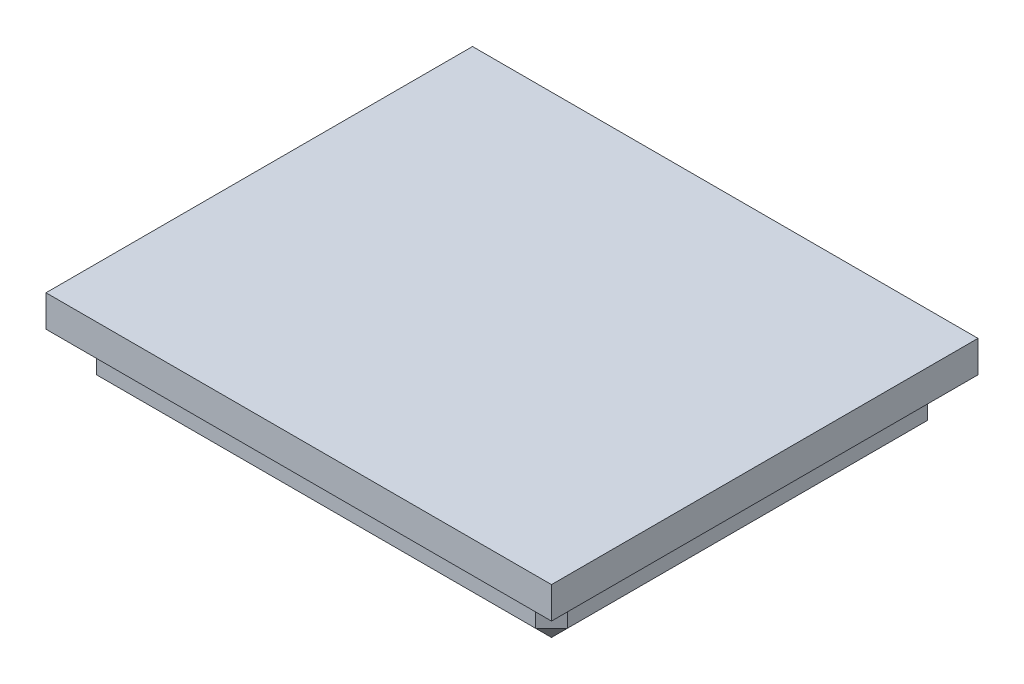
ISO-10303-21;
HEADER;
FILE_DESCRIPTION(('STEP AP214'),'2;1');
FILE_NAME('part.step','',(''),(''),'','','');
FILE_SCHEMA(('AUTOMOTIVE_DESIGN { 1 0 10303 214 1 1 1 1 }'));
ENDSEC;
DATA;
#1=APPLICATION_CONTEXT('core data for automotive mechanical design processes');
#2=APPLICATION_PROTOCOL_DEFINITION('international standard','automotive_design',2000,#1);
#3=PRODUCT_CONTEXT('',#1,'mechanical');
#4=PRODUCT('Part','Part','',(#3));
#5=PRODUCT_RELATED_PRODUCT_CATEGORY('part','',(#4));
#6=PRODUCT_DEFINITION_FORMATION('','',#4);
#7=PRODUCT_DEFINITION_CONTEXT('part definition',#1,'design');
#8=PRODUCT_DEFINITION('design','',#6,#7);
#9=PRODUCT_DEFINITION_SHAPE('','',#8);
#10=(LENGTH_UNIT() NAMED_UNIT(*) SI_UNIT(.MILLI.,.METRE.));
#11=(NAMED_UNIT(*) PLANE_ANGLE_UNIT() SI_UNIT($,.RADIAN.));
#12=(NAMED_UNIT(*) SI_UNIT($,.STERADIAN.) SOLID_ANGLE_UNIT());
#13=UNCERTAINTY_MEASURE_WITH_UNIT(LENGTH_MEASURE(1.E-05),#10,'distance_accuracy_value','');
#14=(GEOMETRIC_REPRESENTATION_CONTEXT(3) GLOBAL_UNCERTAINTY_ASSIGNED_CONTEXT((#13)) GLOBAL_UNIT_ASSIGNED_CONTEXT((#10,
#11,#12)) REPRESENTATION_CONTEXT('',''));
#15=CARTESIAN_POINT('',(0.,0.,0.));
#16=DIRECTION('',(0.,0.,1.));
#17=DIRECTION('',(1.,0.,0.));
#18=AXIS2_PLACEMENT_3D('',#15,#16,#17);
#19=CARTESIAN_POINT('',(-14.9,3.,12.4));
#20=DIRECTION('',(1.,0.,0.));
#21=DIRECTION('',(0.,0.,-1.));
#22=AXIS2_PLACEMENT_3D('',#19,#20,#21);
#23=PLANE('',#22);
#24=DIRECTION('',(0.,0.,1.));
#25=VECTOR('',#24,1.);
#26=CARTESIAN_POINT('',(-14.9,1.,12.4));
#27=LINE('',#26,#25);
#28=CARTESIAN_POINT('',(-14.9,1.,-11.4));
#29=VERTEX_POINT('',#28);
#30=CARTESIAN_POINT('',(-14.9,1.,11.4));
#31=VERTEX_POINT('',#30);
#32=EDGE_CURVE('E191',#29,#31,#27,.T.);
#33=ORIENTED_EDGE('',*,*,#32,.T.);
#34=DIRECTION('',(0.,1.,0.));
#35=VECTOR('',#34,1.);
#36=CARTESIAN_POINT('',(-14.9,3.,11.4));
#37=LINE('',#36,#35);
#38=CARTESIAN_POINT('',(-14.9,3.,11.4));
#39=VERTEX_POINT('',#38);
#40=EDGE_CURVE('E195',#31,#39,#37,.T.);
#41=ORIENTED_EDGE('',*,*,#40,.T.);
#42=DIRECTION('',(0.,0.,1.));
#43=VECTOR('',#42,1.);
#44=CARTESIAN_POINT('',(-14.9,3.,12.4));
#45=LINE('',#44,#43);
#46=CARTESIAN_POINT('',(-14.9,3.,-11.4));
#47=VERTEX_POINT('',#46);
#48=EDGE_CURVE('E161',#47,#39,#45,.T.);
#49=ORIENTED_EDGE('',*,*,#48,.F.);
#50=DIRECTION('',(0.,-1.,0.));
#51=VECTOR('',#50,1.);
#52=CARTESIAN_POINT('',(-14.9,3.,-11.4));
#53=LINE('',#52,#51);
#54=EDGE_CURVE('E193',#47,#29,#53,.T.);
#55=ORIENTED_EDGE('',*,*,#54,.T.);
#56=EDGE_LOOP('',(#33,#41,#49,#55));
#57=FACE_BOUND('',#56,.T.);
#58=ADVANCED_FACE('F35',(#57),#23,.F.);
#59=CARTESIAN_POINT('',(14.9,3.,12.4));
#60=DIRECTION('',(0.,0.,-1.));
#61=DIRECTION('',(-1.,0.,0.));
#62=AXIS2_PLACEMENT_3D('',#59,#60,#61);
#63=PLANE('',#62);
#64=DIRECTION('',(1.,0.,0.));
#65=VECTOR('',#64,1.);
#66=CARTESIAN_POINT('',(14.9,1.,12.4));
#67=LINE('',#66,#65);
#68=CARTESIAN_POINT('',(-13.9,1.,12.4));
#69=VERTEX_POINT('',#68);
#70=CARTESIAN_POINT('',(13.9,1.,12.4));
#71=VERTEX_POINT('',#70);
#72=EDGE_CURVE('E185',#69,#71,#67,.T.);
#73=ORIENTED_EDGE('',*,*,#72,.T.);
#74=DIRECTION('',(0.,1.,0.));
#75=VECTOR('',#74,1.);
#76=CARTESIAN_POINT('',(13.9,3.,12.4));
#77=LINE('',#76,#75);
#78=CARTESIAN_POINT('',(13.9,3.,12.4));
#79=VERTEX_POINT('',#78);
#80=EDGE_CURVE('E189',#71,#79,#77,.T.);
#81=ORIENTED_EDGE('',*,*,#80,.T.);
#82=DIRECTION('',(1.,0.,0.));
#83=VECTOR('',#82,1.);
#84=CARTESIAN_POINT('',(14.9,3.,12.4));
#85=LINE('',#84,#83);
#86=CARTESIAN_POINT('',(-13.9,3.,12.4));
#87=VERTEX_POINT('',#86);
#88=EDGE_CURVE('E164',#87,#79,#85,.T.);
#89=ORIENTED_EDGE('',*,*,#88,.F.);
#90=DIRECTION('',(0.,-1.,0.));
#91=VECTOR('',#90,1.);
#92=CARTESIAN_POINT('',(-13.9,3.,12.4));
#93=LINE('',#92,#91);
#94=EDGE_CURVE('E187',#87,#69,#93,.T.);
#95=ORIENTED_EDGE('',*,*,#94,.T.);
#96=EDGE_LOOP('',(#73,#81,#89,#95));
#97=FACE_BOUND('',#96,.T.);
#98=ADVANCED_FACE('F281',(#97),#63,.F.);
#99=CARTESIAN_POINT('',(14.9,3.,12.4));
#100=DIRECTION('',(-1.,0.,0.));
#101=DIRECTION('',(0.,0.,1.));
#102=AXIS2_PLACEMENT_3D('',#99,#100,#101);
#103=PLANE('',#102);
#104=DIRECTION('',(0.,0.,-1.));
#105=VECTOR('',#104,1.);
#106=CARTESIAN_POINT('',(14.9,3.,12.4));
#107=LINE('',#106,#105);
#108=CARTESIAN_POINT('',(14.9,3.,11.4));
#109=VERTEX_POINT('',#108);
#110=CARTESIAN_POINT('',(14.9,3.,-11.4));
#111=VERTEX_POINT('',#110);
#112=EDGE_CURVE('E172',#109,#111,#107,.T.);
#113=ORIENTED_EDGE('',*,*,#112,.F.);
#114=DIRECTION('',(0.,-1.,0.));
#115=VECTOR('',#114,1.);
#116=CARTESIAN_POINT('',(14.9,3.,11.4));
#117=LINE('',#116,#115);
#118=CARTESIAN_POINT('',(14.9,1.,11.4));
#119=VERTEX_POINT('',#118);
#120=EDGE_CURVE('E182',#109,#119,#117,.T.);
#121=ORIENTED_EDGE('',*,*,#120,.T.);
#122=DIRECTION('',(0.,0.,-1.));
#123=VECTOR('',#122,1.);
#124=CARTESIAN_POINT('',(14.9,1.,12.4));
#125=LINE('',#124,#123);
#126=CARTESIAN_POINT('',(14.9,1.,-11.4));
#127=VERTEX_POINT('',#126);
#128=EDGE_CURVE('E178',#119,#127,#125,.T.);
#129=ORIENTED_EDGE('',*,*,#128,.T.);
#130=DIRECTION('',(0.,1.,0.));
#131=VECTOR('',#130,1.);
#132=CARTESIAN_POINT('',(14.9,3.,-11.4));
#133=LINE('',#132,#131);
#134=EDGE_CURVE('E180',#127,#111,#133,.T.);
#135=ORIENTED_EDGE('',*,*,#134,.T.);
#136=EDGE_LOOP('',(#113,#121,#129,#135));
#137=FACE_BOUND('',#136,.T.);
#138=ADVANCED_FACE('F288',(#137),#103,.F.);
#139=CARTESIAN_POINT('',(14.9,3.,-12.4));
#140=DIRECTION('',(0.,0.,1.));
#141=DIRECTION('',(1.,0.,0.));
#142=AXIS2_PLACEMENT_3D('',#139,#140,#141);
#143=PLANE('',#142);
#144=DIRECTION('',(-1.,0.,0.));
#145=VECTOR('',#144,1.);
#146=CARTESIAN_POINT('',(14.9,1.,-12.4));
#147=LINE('',#146,#145);
#148=CARTESIAN_POINT('',(13.9,1.,-12.4));
#149=VERTEX_POINT('',#148);
#150=CARTESIAN_POINT('',(-13.9,1.,-12.4));
#151=VERTEX_POINT('',#150);
#152=EDGE_CURVE('E197',#149,#151,#147,.T.);
#153=ORIENTED_EDGE('',*,*,#152,.T.);
#154=DIRECTION('',(0.,1.,0.));
#155=VECTOR('',#154,1.);
#156=CARTESIAN_POINT('',(-13.9,3.,-12.4));
#157=LINE('',#156,#155);
#158=CARTESIAN_POINT('',(-13.9,3.,-12.4));
#159=VERTEX_POINT('',#158);
#160=EDGE_CURVE('E201',#151,#159,#157,.T.);
#161=ORIENTED_EDGE('',*,*,#160,.T.);
#162=DIRECTION('',(-1.,0.,0.));
#163=VECTOR('',#162,1.);
#164=CARTESIAN_POINT('',(14.9,3.,-12.4));
#165=LINE('',#164,#163);
#166=CARTESIAN_POINT('',(13.9,3.,-12.4));
#167=VERTEX_POINT('',#166);
#168=EDGE_CURVE('E175',#167,#159,#165,.T.);
#169=ORIENTED_EDGE('',*,*,#168,.F.);
#170=DIRECTION('',(0.,-1.,0.));
#171=VECTOR('',#170,1.);
#172=CARTESIAN_POINT('',(13.9,3.,-12.4));
#173=LINE('',#172,#171);
#174=EDGE_CURVE('E199',#167,#149,#173,.T.);
#175=ORIENTED_EDGE('',*,*,#174,.T.);
#176=EDGE_LOOP('',(#153,#161,#169,#175));
#177=FACE_BOUND('',#176,.T.);
#178=ADVANCED_FACE('F364',(#177),#143,.F.);
#179=CARTESIAN_POINT('',(0.,0.,0.));
#180=DIRECTION('',(0.,1.,0.));
#181=DIRECTION('',(0.,0.,1.));
#182=AXIS2_PLACEMENT_3D('',#179,#180,#181);
#183=PLANE('',#182);
#184=DIRECTION('',(-1.,0.,0.));
#185=VECTOR('',#184,1.);
#186=CARTESIAN_POINT('',(0.,0.,11.4));
#187=LINE('',#186,#185);
#188=CARTESIAN_POINT('',(13.9,0.,11.4));
#189=VERTEX_POINT('',#188);
#190=CARTESIAN_POINT('',(-13.9,0.,11.4));
#191=VERTEX_POINT('',#190);
#192=EDGE_CURVE('E52',#189,#191,#187,.T.);
#193=ORIENTED_EDGE('',*,*,#192,.T.);
#194=DIRECTION('',(0.,0.,-1.));
#195=VECTOR('',#194,1.);
#196=CARTESIAN_POINT('',(-13.9,0.,0.));
#197=LINE('',#196,#195);
#198=CARTESIAN_POINT('',(-13.9,0.,-11.4));
#199=VERTEX_POINT('',#198);
#200=EDGE_CURVE('E207',#191,#199,#197,.T.);
#201=ORIENTED_EDGE('',*,*,#200,.T.);
#202=DIRECTION('',(1.,0.,0.));
#203=VECTOR('',#202,1.);
#204=CARTESIAN_POINT('',(0.,0.,-11.4));
#205=LINE('',#204,#203);
#206=CARTESIAN_POINT('',(13.9,0.,-11.4));
#207=VERTEX_POINT('',#206);
#208=EDGE_CURVE('E203',#199,#207,#205,.T.);
#209=ORIENTED_EDGE('',*,*,#208,.T.);
#210=DIRECTION('',(0.,0.,1.));
#211=VECTOR('',#210,1.);
#212=CARTESIAN_POINT('',(13.9,0.,0.));
#213=LINE('',#212,#211);
#214=EDGE_CURVE('E57',#207,#189,#213,.T.);
#215=ORIENTED_EDGE('',*,*,#214,.T.);
#216=EDGE_LOOP('',(#193,#201,#209,#215));
#217=FACE_BOUND('',#216,.T.);
#218=ADVANCED_FACE('F367',(#217),#183,.F.);
#219=CARTESIAN_POINT('',(0.,3.,0.));
#220=DIRECTION('',(0.,1.,0.));
#221=DIRECTION('',(0.,0.,1.));
#222=AXIS2_PLACEMENT_3D('',#219,#220,#221);
#223=PLANE('',#222);
#224=DIRECTION('',(0.,0.,1.));
#225=VECTOR('',#224,1.);
#226=CARTESIAN_POINT('',(-16.,3.,13.5));
#227=LINE('',#226,#225);
#228=CARTESIAN_POINT('',(-16.,3.,-13.5));
#229=VERTEX_POINT('',#228);
#230=CARTESIAN_POINT('',(-16.,3.,13.5));
#231=VERTEX_POINT('',#230);
#232=EDGE_CURVE('E160',#229,#231,#227,.T.);
#233=ORIENTED_EDGE('',*,*,#232,.F.);
#234=DIRECTION('',(-1.,0.,0.));
#235=VECTOR('',#234,1.);
#236=CARTESIAN_POINT('',(16.,3.,-13.5));
#237=LINE('',#236,#235);
#238=CARTESIAN_POINT('',(16.,3.,-13.5));
#239=VERTEX_POINT('',#238);
#240=EDGE_CURVE('E156',#239,#229,#237,.T.);
#241=ORIENTED_EDGE('',*,*,#240,.F.);
#242=DIRECTION('',(0.,0.,-1.));
#243=VECTOR('',#242,1.);
#244=CARTESIAN_POINT('',(16.,3.,13.5));
#245=LINE('',#244,#243);
#246=CARTESIAN_POINT('',(16.,3.,13.5));
#247=VERTEX_POINT('',#246);
#248=EDGE_CURVE('E253',#247,#239,#245,.T.);
#249=ORIENTED_EDGE('',*,*,#248,.F.);
#250=DIRECTION('',(1.,0.,0.));
#251=VECTOR('',#250,1.);
#252=CARTESIAN_POINT('',(16.,3.,13.5));
#253=LINE('',#252,#251);
#254=EDGE_CURVE('E251',#231,#247,#253,.T.);
#255=ORIENTED_EDGE('',*,*,#254,.F.);
#256=EDGE_LOOP('',(#233,#241,#249,#255));
#257=FACE_BOUND('',#256,.T.);
#258=ORIENTED_EDGE('',*,*,#112,.T.);
#259=DIRECTION('',(0.707106781186548,0.,0.707106781186548));
#260=VECTOR('',#259,1.);
#261=CARTESIAN_POINT('',(13.15,3.,-13.15));
#262=LINE('',#261,#260);
#263=EDGE_CURVE('E11',#111,#167,#262,.F.);
#264=ORIENTED_EDGE('',*,*,#263,.T.);
#265=ORIENTED_EDGE('',*,*,#168,.T.);
#266=DIRECTION('',(0.707106781186548,0.,-0.707106781186548));
#267=VECTOR('',#266,1.);
#268=CARTESIAN_POINT('',(-13.15,3.,-13.15));
#269=LINE('',#268,#267);
#270=EDGE_CURVE('E44',#159,#47,#269,.F.);
#271=ORIENTED_EDGE('',*,*,#270,.T.);
#272=ORIENTED_EDGE('',*,*,#48,.T.);
#273=DIRECTION('',(-0.707106781186548,0.,-0.707106781186548));
#274=VECTOR('',#273,1.);
#275=CARTESIAN_POINT('',(-13.15,3.,13.15));
#276=LINE('',#275,#274);
#277=EDGE_CURVE('E211',#39,#87,#276,.F.);
#278=ORIENTED_EDGE('',*,*,#277,.T.);
#279=ORIENTED_EDGE('',*,*,#88,.T.);
#280=DIRECTION('',(-0.707106781186548,0.,0.707106781186548));
#281=VECTOR('',#280,1.);
#282=CARTESIAN_POINT('',(13.15,3.,13.15));
#283=LINE('',#282,#281);
#284=EDGE_CURVE('E209',#79,#109,#283,.F.);
#285=ORIENTED_EDGE('',*,*,#284,.T.);
#286=EDGE_LOOP('',(#258,#264,#265,#271,#272,#278,#279,#285));
#287=FACE_BOUND('',#286,.T.);
#288=ADVANCED_FACE('F269',(#257,#287),#223,.F.);
#289=CARTESIAN_POINT('',(-16.,5.,13.5));
#290=DIRECTION('',(1.,0.,0.));
#291=DIRECTION('',(0.,0.,-1.));
#292=AXIS2_PLACEMENT_3D('',#289,#290,#291);
#293=PLANE('',#292);
#294=ORIENTED_EDGE('',*,*,#232,.T.);
#295=DIRECTION('',(0.,-1.,0.));
#296=VECTOR('',#295,1.);
#297=CARTESIAN_POINT('',(-16.,5.,13.5));
#298=LINE('',#297,#296);
#299=CARTESIAN_POINT('',(-16.,5.,13.5));
#300=VERTEX_POINT('',#299);
#301=EDGE_CURVE('E140',#300,#231,#298,.T.);
#302=ORIENTED_EDGE('',*,*,#301,.F.);
#303=DIRECTION('',(0.,0.,1.));
#304=VECTOR('',#303,1.);
#305=CARTESIAN_POINT('',(-16.,5.,13.5));
#306=LINE('',#305,#304);
#307=CARTESIAN_POINT('',(-16.,5.,-13.5));
#308=VERTEX_POINT('',#307);
#309=EDGE_CURVE('E147',#308,#300,#306,.T.);
#310=ORIENTED_EDGE('',*,*,#309,.F.);
#311=DIRECTION('',(0.,-1.,0.));
#312=VECTOR('',#311,1.);
#313=CARTESIAN_POINT('',(-16.,5.,-13.5));
#314=LINE('',#313,#312);
#315=EDGE_CURVE('E260',#308,#229,#314,.T.);
#316=ORIENTED_EDGE('',*,*,#315,.T.);
#317=EDGE_LOOP('',(#294,#302,#310,#316));
#318=FACE_BOUND('',#317,.T.);
#319=ADVANCED_FACE('F158',(#318),#293,.F.);
#320=CARTESIAN_POINT('',(16.,5.,13.5));
#321=DIRECTION('',(0.,0.,-1.));
#322=DIRECTION('',(-1.,0.,0.));
#323=AXIS2_PLACEMENT_3D('',#320,#321,#322);
#324=PLANE('',#323);
#325=ORIENTED_EDGE('',*,*,#254,.T.);
#326=DIRECTION('',(0.,-1.,0.));
#327=VECTOR('',#326,1.);
#328=CARTESIAN_POINT('',(16.,5.,13.5));
#329=LINE('',#328,#327);
#330=CARTESIAN_POINT('',(16.,5.,13.5));
#331=VERTEX_POINT('',#330);
#332=EDGE_CURVE('E143',#331,#247,#329,.T.);
#333=ORIENTED_EDGE('',*,*,#332,.F.);
#334=DIRECTION('',(1.,0.,0.));
#335=VECTOR('',#334,1.);
#336=CARTESIAN_POINT('',(16.,5.,13.5));
#337=LINE('',#336,#335);
#338=EDGE_CURVE('E136',#300,#331,#337,.T.);
#339=ORIENTED_EDGE('',*,*,#338,.F.);
#340=ORIENTED_EDGE('',*,*,#301,.T.);
#341=EDGE_LOOP('',(#325,#333,#339,#340));
#342=FACE_BOUND('',#341,.T.);
#343=ADVANCED_FACE('F138',(#342),#324,.F.);
#344=CARTESIAN_POINT('',(16.,5.,13.5));
#345=DIRECTION('',(-1.,0.,0.));
#346=DIRECTION('',(0.,0.,1.));
#347=AXIS2_PLACEMENT_3D('',#344,#345,#346);
#348=PLANE('',#347);
#349=ORIENTED_EDGE('',*,*,#248,.T.);
#350=DIRECTION('',(0.,-1.,0.));
#351=VECTOR('',#350,1.);
#352=CARTESIAN_POINT('',(16.,5.,-13.5));
#353=LINE('',#352,#351);
#354=CARTESIAN_POINT('',(16.,5.,-13.5));
#355=VERTEX_POINT('',#354);
#356=EDGE_CURVE('E166',#355,#239,#353,.T.);
#357=ORIENTED_EDGE('',*,*,#356,.F.);
#358=DIRECTION('',(0.,0.,-1.));
#359=VECTOR('',#358,1.);
#360=CARTESIAN_POINT('',(16.,5.,13.5));
#361=LINE('',#360,#359);
#362=EDGE_CURVE('E146',#331,#355,#361,.T.);
#363=ORIENTED_EDGE('',*,*,#362,.F.);
#364=ORIENTED_EDGE('',*,*,#332,.T.);
#365=EDGE_LOOP('',(#349,#357,#363,#364));
#366=FACE_BOUND('',#365,.T.);
#367=ADVANCED_FACE('F271',(#366),#348,.F.);
#368=CARTESIAN_POINT('',(16.,5.,-13.5));
#369=DIRECTION('',(0.,0.,1.));
#370=DIRECTION('',(1.,0.,0.));
#371=AXIS2_PLACEMENT_3D('',#368,#369,#370);
#372=PLANE('',#371);
#373=ORIENTED_EDGE('',*,*,#240,.T.);
#374=ORIENTED_EDGE('',*,*,#315,.F.);
#375=DIRECTION('',(-1.,0.,0.));
#376=VECTOR('',#375,1.);
#377=CARTESIAN_POINT('',(16.,5.,-13.5));
#378=LINE('',#377,#376);
#379=EDGE_CURVE('E152',#355,#308,#378,.T.);
#380=ORIENTED_EDGE('',*,*,#379,.F.);
#381=ORIENTED_EDGE('',*,*,#356,.T.);
#382=EDGE_LOOP('',(#373,#374,#380,#381));
#383=FACE_BOUND('',#382,.T.);
#384=ADVANCED_FACE('F265',(#383),#372,.F.);
#385=CARTESIAN_POINT('',(0.,5.,0.));
#386=DIRECTION('',(0.,1.,0.));
#387=DIRECTION('',(0.,0.,1.));
#388=AXIS2_PLACEMENT_3D('',#385,#386,#387);
#389=PLANE('',#388);
#390=ORIENTED_EDGE('',*,*,#309,.T.);
#391=ORIENTED_EDGE('',*,*,#338,.T.);
#392=ORIENTED_EDGE('',*,*,#362,.T.);
#393=ORIENTED_EDGE('',*,*,#379,.T.);
#394=EDGE_LOOP('',(#390,#391,#392,#393));
#395=FACE_BOUND('',#394,.T.);
#396=ADVANCED_FACE('F150',(#395),#389,.T.);
#397=CARTESIAN_POINT('',(-14.9,3.,-11.4));
#398=DIRECTION('',(0.707106781186547,0.,0.707106781186547));
#399=DIRECTION('',(0.,-1.,0.));
#400=AXIS2_PLACEMENT_3D('',#397,#398,#399);
#401=PLANE('',#400);
#402=DIRECTION('',(-0.707106781186547,0.,0.707106781186547));
#403=VECTOR('',#402,1.);
#404=CARTESIAN_POINT('',(-14.9,1.,-11.4));
#405=LINE('',#404,#403);
#406=EDGE_CURVE('E39',#29,#151,#405,.F.);
#407=ORIENTED_EDGE('',*,*,#406,.F.);
#408=ORIENTED_EDGE('',*,*,#54,.F.);
#409=ORIENTED_EDGE('',*,*,#270,.F.);
#410=ORIENTED_EDGE('',*,*,#160,.F.);
#411=EDGE_LOOP('',(#407,#408,#409,#410));
#412=FACE_BOUND('',#411,.T.);
#413=ADVANCED_FACE('F37',(#412),#401,.F.);
#414=CARTESIAN_POINT('',(-14.9,1.,-11.4));
#415=DIRECTION('',(-0.577350269189626,-0.577350269189626,-0.577350269189626));
#416=DIRECTION('',(-0.707106781186547,0.,0.707106781186547));
#417=AXIS2_PLACEMENT_3D('',#414,#415,#416);
#418=PLANE('',#417);
#419=DIRECTION('',(0.707106781186547,-0.707106781186547,0.));
#420=VECTOR('',#419,1.);
#421=CARTESIAN_POINT('',(-14.9,1.,-11.4));
#422=LINE('',#421,#420);
#423=EDGE_CURVE('E240',#29,#199,#422,.T.);
#424=ORIENTED_EDGE('',*,*,#423,.F.);
#425=ORIENTED_EDGE('',*,*,#406,.T.);
#426=DIRECTION('',(0.,0.707106781186547,-0.707106781186547));
#427=VECTOR('',#426,1.);
#428=CARTESIAN_POINT('',(-13.9,0.5,-11.9));
#429=LINE('',#428,#427);
#430=EDGE_CURVE('E242',#199,#151,#429,.T.);
#431=ORIENTED_EDGE('',*,*,#430,.F.);
#432=EDGE_LOOP('',(#424,#425,#431));
#433=FACE_BOUND('',#432,.T.);
#434=ADVANCED_FACE('F330',(#433),#418,.T.);
#435=CARTESIAN_POINT('',(13.9,3.,-12.4));
#436=DIRECTION('',(-0.707106781186547,0.,0.707106781186547));
#437=DIRECTION('',(0.,-1.,0.));
#438=AXIS2_PLACEMENT_3D('',#435,#436,#437);
#439=PLANE('',#438);
#440=ORIENTED_EDGE('',*,*,#263,.F.);
#441=ORIENTED_EDGE('',*,*,#134,.F.);
#442=DIRECTION('',(-0.707106781186547,0.,-0.707106781186547));
#443=VECTOR('',#442,1.);
#444=CARTESIAN_POINT('',(13.9,1.,-12.4));
#445=LINE('',#444,#443);
#446=EDGE_CURVE('E237',#149,#127,#445,.F.);
#447=ORIENTED_EDGE('',*,*,#446,.F.);
#448=ORIENTED_EDGE('',*,*,#174,.F.);
#449=EDGE_LOOP('',(#440,#441,#447,#448));
#450=FACE_BOUND('',#449,.T.);
#451=ADVANCED_FACE('F328',(#450),#439,.F.);
#452=CARTESIAN_POINT('',(14.9,1.,-12.4));
#453=DIRECTION('',(0.,0.707106781186547,0.707106781186547));
#454=DIRECTION('',(-1.,0.,0.));
#455=AXIS2_PLACEMENT_3D('',#452,#453,#454);
#456=PLANE('',#455);
#457=ORIENTED_EDGE('',*,*,#430,.T.);
#458=ORIENTED_EDGE('',*,*,#152,.F.);
#459=DIRECTION('',(0.,-0.707106781186548,0.707106781186548));
#460=VECTOR('',#459,1.);
#461=CARTESIAN_POINT('',(13.9,1.,-12.4));
#462=LINE('',#461,#460);
#463=EDGE_CURVE('E234',#207,#149,#462,.F.);
#464=ORIENTED_EDGE('',*,*,#463,.F.);
#465=ORIENTED_EDGE('',*,*,#208,.F.);
#466=EDGE_LOOP('',(#457,#458,#464,#465));
#467=FACE_BOUND('',#466,.T.);
#468=ADVANCED_FACE('F324',(#467),#456,.F.);
#469=CARTESIAN_POINT('',(-14.9,1.,12.4));
#470=DIRECTION('',(0.707106781186547,0.707106781186547,0.));
#471=DIRECTION('',(0.,0.,1.));
#472=AXIS2_PLACEMENT_3D('',#469,#470,#471);
#473=PLANE('',#472);
#474=ORIENTED_EDGE('',*,*,#423,.T.);
#475=ORIENTED_EDGE('',*,*,#200,.F.);
#476=DIRECTION('',(-0.707106781186547,0.707106781186547,0.));
#477=VECTOR('',#476,1.);
#478=CARTESIAN_POINT('',(-14.4,0.5,11.4));
#479=LINE('',#478,#477);
#480=EDGE_CURVE('E231',#31,#191,#479,.F.);
#481=ORIENTED_EDGE('',*,*,#480,.F.);
#482=ORIENTED_EDGE('',*,*,#32,.F.);
#483=EDGE_LOOP('',(#474,#475,#481,#482));
#484=FACE_BOUND('',#483,.T.);
#485=ADVANCED_FACE('F320',(#484),#473,.F.);
#486=CARTESIAN_POINT('',(-13.9,3.,12.4));
#487=DIRECTION('',(0.707106781186547,0.,-0.707106781186547));
#488=DIRECTION('',(0.,-1.,0.));
#489=AXIS2_PLACEMENT_3D('',#486,#487,#488);
#490=PLANE('',#489);
#491=ORIENTED_EDGE('',*,*,#277,.F.);
#492=ORIENTED_EDGE('',*,*,#40,.F.);
#493=DIRECTION('',(0.707106781186547,0.,0.707106781186547));
#494=VECTOR('',#493,1.);
#495=CARTESIAN_POINT('',(-13.9,1.,12.4));
#496=LINE('',#495,#494);
#497=EDGE_CURVE('E228',#69,#31,#496,.F.);
#498=ORIENTED_EDGE('',*,*,#497,.F.);
#499=ORIENTED_EDGE('',*,*,#94,.F.);
#500=EDGE_LOOP('',(#491,#492,#498,#499));
#501=FACE_BOUND('',#500,.T.);
#502=ADVANCED_FACE('F316',(#501),#490,.F.);
#503=CARTESIAN_POINT('',(13.9,1.,-12.4));
#504=DIRECTION('',(0.577350269189626,-0.577350269189626,-0.577350269189626));
#505=DIRECTION('',(-0.707106781186547,0.,-0.707106781186547));
#506=AXIS2_PLACEMENT_3D('',#503,#504,#505);
#507=PLANE('',#506);
#508=ORIENTED_EDGE('',*,*,#463,.T.);
#509=ORIENTED_EDGE('',*,*,#446,.T.);
#510=DIRECTION('',(0.707106781186547,0.707106781186547,0.));
#511=VECTOR('',#510,1.);
#512=CARTESIAN_POINT('',(14.4,0.5,-11.4));
#513=LINE('',#512,#511);
#514=EDGE_CURVE('E225',#207,#127,#513,.T.);
#515=ORIENTED_EDGE('',*,*,#514,.F.);
#516=EDGE_LOOP('',(#508,#509,#515));
#517=FACE_BOUND('',#516,.T.);
#518=ADVANCED_FACE('F312',(#517),#507,.T.);
#519=CARTESIAN_POINT('',(-13.9,1.,12.4));
#520=DIRECTION('',(-0.577350269189626,-0.577350269189626,0.577350269189626));
#521=DIRECTION('',(0.707106781186547,0.,0.707106781186547));
#522=AXIS2_PLACEMENT_3D('',#519,#520,#521);
#523=PLANE('',#522);
#524=ORIENTED_EDGE('',*,*,#497,.T.);
#525=ORIENTED_EDGE('',*,*,#480,.T.);
#526=DIRECTION('',(0.,-0.707106781186548,-0.707106781186548));
#527=VECTOR('',#526,1.);
#528=CARTESIAN_POINT('',(-13.9,1.,12.4));
#529=LINE('',#528,#527);
#530=EDGE_CURVE('E222',#69,#191,#529,.T.);
#531=ORIENTED_EDGE('',*,*,#530,.F.);
#532=EDGE_LOOP('',(#524,#525,#531));
#533=FACE_BOUND('',#532,.T.);
#534=ADVANCED_FACE('F308',(#533),#523,.T.);
#535=CARTESIAN_POINT('',(14.9,1.,12.4));
#536=DIRECTION('',(-0.707106781186547,0.707106781186547,0.));
#537=DIRECTION('',(0.,0.,-1.));
#538=AXIS2_PLACEMENT_3D('',#535,#536,#537);
#539=PLANE('',#538);
#540=ORIENTED_EDGE('',*,*,#514,.T.);
#541=ORIENTED_EDGE('',*,*,#128,.F.);
#542=DIRECTION('',(-0.707106781186547,-0.707106781186547,0.));
#543=VECTOR('',#542,1.);
#544=CARTESIAN_POINT('',(14.9,1.,11.4));
#545=LINE('',#544,#543);
#546=EDGE_CURVE('E219',#189,#119,#545,.F.);
#547=ORIENTED_EDGE('',*,*,#546,.F.);
#548=ORIENTED_EDGE('',*,*,#214,.F.);
#549=EDGE_LOOP('',(#540,#541,#547,#548));
#550=FACE_BOUND('',#549,.T.);
#551=ADVANCED_FACE('F304',(#550),#539,.F.);
#552=CARTESIAN_POINT('',(14.9,1.,12.4));
#553=DIRECTION('',(0.,0.707106781186547,-0.707106781186547));
#554=DIRECTION('',(1.,0.,0.));
#555=AXIS2_PLACEMENT_3D('',#552,#553,#554);
#556=PLANE('',#555);
#557=ORIENTED_EDGE('',*,*,#530,.T.);
#558=ORIENTED_EDGE('',*,*,#192,.F.);
#559=DIRECTION('',(0.,0.707106781186547,0.707106781186547));
#560=VECTOR('',#559,1.);
#561=CARTESIAN_POINT('',(13.9,0.5,11.9));
#562=LINE('',#561,#560);
#563=EDGE_CURVE('E216',#71,#189,#562,.F.);
#564=ORIENTED_EDGE('',*,*,#563,.F.);
#565=ORIENTED_EDGE('',*,*,#72,.F.);
#566=EDGE_LOOP('',(#557,#558,#564,#565));
#567=FACE_BOUND('',#566,.T.);
#568=ADVANCED_FACE('F300',(#567),#556,.F.);
#569=CARTESIAN_POINT('',(14.9,1.,11.4));
#570=DIRECTION('',(0.577350269189626,-0.577350269189626,0.577350269189626));
#571=DIRECTION('',(0.707106781186547,0.,-0.707106781186547));
#572=AXIS2_PLACEMENT_3D('',#569,#570,#571);
#573=PLANE('',#572);
#574=ORIENTED_EDGE('',*,*,#563,.T.);
#575=ORIENTED_EDGE('',*,*,#546,.T.);
#576=DIRECTION('',(0.707106781186547,0.,-0.707106781186547));
#577=VECTOR('',#576,1.);
#578=CARTESIAN_POINT('',(14.9,1.,11.4));
#579=LINE('',#578,#577);
#580=EDGE_CURVE('E214',#71,#119,#579,.T.);
#581=ORIENTED_EDGE('',*,*,#580,.F.);
#582=EDGE_LOOP('',(#574,#575,#581));
#583=FACE_BOUND('',#582,.T.);
#584=ADVANCED_FACE('F296',(#583),#573,.T.);
#585=CARTESIAN_POINT('',(14.9,3.,11.4));
#586=DIRECTION('',(-0.707106781186547,0.,-0.707106781186547));
#587=DIRECTION('',(0.,-1.,0.));
#588=AXIS2_PLACEMENT_3D('',#585,#586,#587);
#589=PLANE('',#588);
#590=ORIENTED_EDGE('',*,*,#284,.F.);
#591=ORIENTED_EDGE('',*,*,#80,.F.);
#592=ORIENTED_EDGE('',*,*,#580,.T.);
#593=ORIENTED_EDGE('',*,*,#120,.F.);
#594=EDGE_LOOP('',(#590,#591,#592,#593));
#595=FACE_BOUND('',#594,.T.);
#596=ADVANCED_FACE('F293',(#595),#589,.F.);
#597=CLOSED_SHELL('',(#58,#98,#138,#178,#218,#288,#319,#343,#367,#384,#396,#413,#434,#451,#468,
#485,#502,#518,#534,#551,#568,#584,#596));
#598=MANIFOLD_SOLID_BREP('B2',#597);
#599=ADVANCED_BREP_SHAPE_REPRESENTATION('',(#18,#598),#14);
#600=SHAPE_DEFINITION_REPRESENTATION(#9,#599);
ENDSEC;
END-ISO-10303-21;
